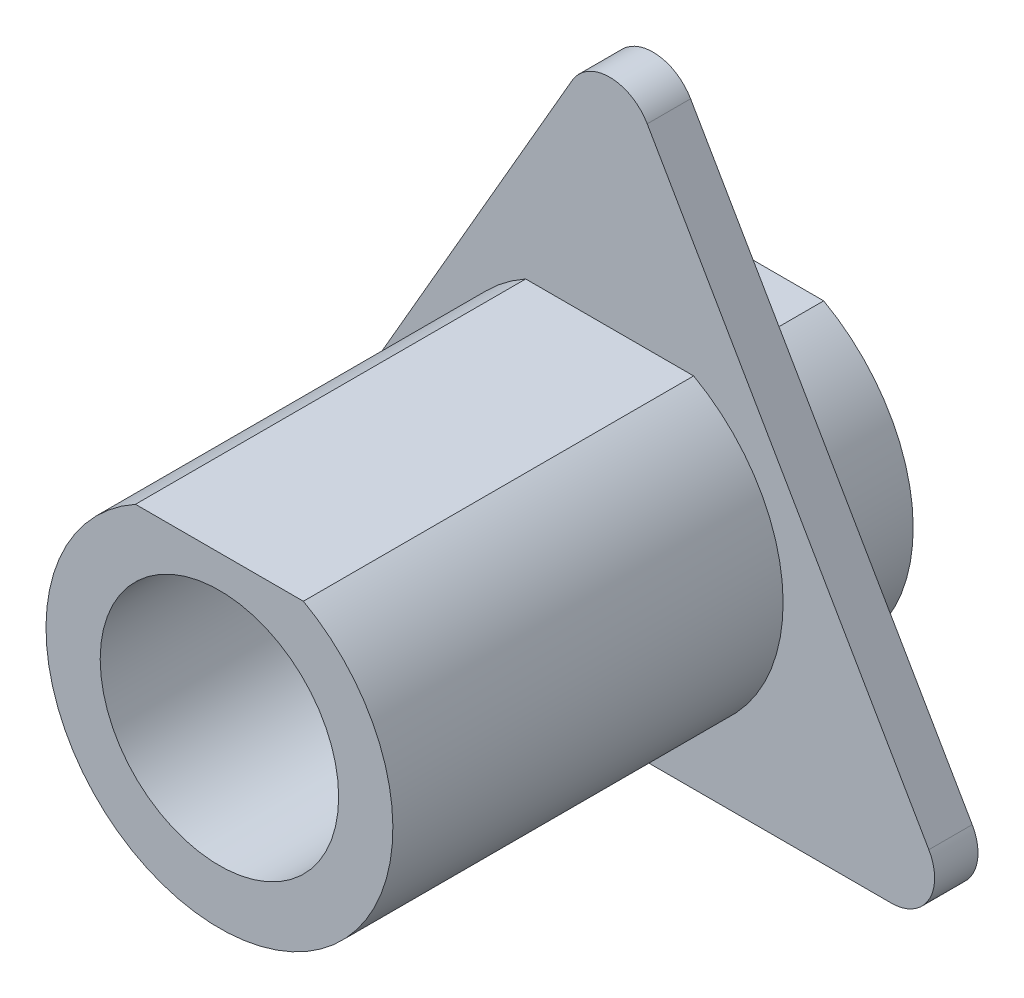
ISO-10303-21;
HEADER;
FILE_DESCRIPTION(('STEP AP214'),'2;1');
FILE_NAME('part.step','',(''),(''),'','','');
FILE_SCHEMA(('AUTOMOTIVE_DESIGN { 1 0 10303 214 1 1 1 1 }'));
ENDSEC;
DATA;
#1=APPLICATION_CONTEXT('core data for automotive mechanical design processes');
#2=APPLICATION_PROTOCOL_DEFINITION('international standard','automotive_design',2000,#1);
#3=PRODUCT_CONTEXT('',#1,'mechanical');
#4=PRODUCT('Part','Part','',(#3));
#5=PRODUCT_RELATED_PRODUCT_CATEGORY('part','',(#4));
#6=PRODUCT_DEFINITION_FORMATION('','',#4);
#7=PRODUCT_DEFINITION_CONTEXT('part definition',#1,'design');
#8=PRODUCT_DEFINITION('design','',#6,#7);
#9=PRODUCT_DEFINITION_SHAPE('','',#8);
#10=(LENGTH_UNIT() NAMED_UNIT(*) SI_UNIT(.MILLI.,.METRE.));
#11=(NAMED_UNIT(*) PLANE_ANGLE_UNIT() SI_UNIT($,.RADIAN.));
#12=(NAMED_UNIT(*) SI_UNIT($,.STERADIAN.) SOLID_ANGLE_UNIT());
#13=UNCERTAINTY_MEASURE_WITH_UNIT(LENGTH_MEASURE(1.E-05),#10,'distance_accuracy_value','');
#14=(GEOMETRIC_REPRESENTATION_CONTEXT(3) GLOBAL_UNCERTAINTY_ASSIGNED_CONTEXT((#13)) GLOBAL_UNIT_ASSIGNED_CONTEXT((#10,
#11,#12)) REPRESENTATION_CONTEXT('',''));
#15=CARTESIAN_POINT('',(0.,0.,0.));
#16=DIRECTION('',(0.,0.,1.));
#17=DIRECTION('',(1.,0.,0.));
#18=AXIS2_PLACEMENT_3D('',#15,#16,#17);
#19=CARTESIAN_POINT('',(0.,0.,12.));
#20=DIRECTION('',(0.,0.,-1.));
#21=DIRECTION('',(-1.,0.,0.));
#22=AXIS2_PLACEMENT_3D('',#19,#20,#21);
#23=CYLINDRICAL_SURFACE('',#22,4.);
#24=CARTESIAN_POINT('',(0.,0.,2.));
#25=DIRECTION('',(0.,0.,1.));
#26=DIRECTION('',(1.,0.,0.));
#27=AXIS2_PLACEMENT_3D('',#24,#25,#26);
#28=CIRCLE('',#27,4.);
#29=CARTESIAN_POINT('',(-1.93649167310371,3.5,2.));
#30=VERTEX_POINT('',#29);
#31=CARTESIAN_POINT('',(1.93649167310371,3.5,2.));
#32=VERTEX_POINT('',#31);
#33=EDGE_CURVE('E198',#30,#32,#28,.T.);
#34=ORIENTED_EDGE('',*,*,#33,.F.);
#35=DIRECTION('',(0.,0.,-1.));
#36=VECTOR('',#35,1.);
#37=CARTESIAN_POINT('',(-1.93649167310371,3.5,12.));
#38=LINE('',#37,#36);
#39=CARTESIAN_POINT('',(-1.93649167310371,3.5,0.));
#40=VERTEX_POINT('',#39);
#41=EDGE_CURVE('E211',#30,#40,#38,.T.);
#42=ORIENTED_EDGE('',*,*,#41,.T.);
#43=CARTESIAN_POINT('',(0.,0.,0.));
#44=DIRECTION('',(0.,0.,1.));
#45=DIRECTION('',(1.,0.,0.));
#46=AXIS2_PLACEMENT_3D('',#43,#44,#45);
#47=CIRCLE('',#46,4.);
#48=CARTESIAN_POINT('',(1.93649167310371,3.5,0.));
#49=VERTEX_POINT('',#48);
#50=EDGE_CURVE('E202',#40,#49,#47,.T.);
#51=ORIENTED_EDGE('',*,*,#50,.T.);
#52=DIRECTION('',(0.,0.,-1.));
#53=VECTOR('',#52,1.);
#54=CARTESIAN_POINT('',(1.93649167310371,3.5,12.));
#55=LINE('',#54,#53);
#56=EDGE_CURVE('E222',#32,#49,#55,.T.);
#57=ORIENTED_EDGE('',*,*,#56,.F.);
#58=EDGE_LOOP('',(#34,#42,#51,#57));
#59=FACE_BOUND('',#58,.T.);
#60=ADVANCED_FACE('F39',(#59),#23,.T.);
#61=CARTESIAN_POINT('',(-1.93649167310371,3.5,12.));
#62=DIRECTION('',(0.,-1.,0.));
#63=DIRECTION('',(0.,0.,-1.));
#64=AXIS2_PLACEMENT_3D('',#61,#62,#63);
#65=PLANE('',#64);
#66=DIRECTION('',(-1.,0.,0.));
#67=VECTOR('',#66,1.);
#68=CARTESIAN_POINT('',(-1.93649167310371,3.5,2.));
#69=LINE('',#68,#67);
#70=EDGE_CURVE('E11',#32,#30,#69,.T.);
#71=ORIENTED_EDGE('',*,*,#70,.F.);
#72=ORIENTED_EDGE('',*,*,#56,.T.);
#73=DIRECTION('',(-1.,0.,0.));
#74=VECTOR('',#73,1.);
#75=CARTESIAN_POINT('',(-1.93649167310371,3.5,0.));
#76=LINE('',#75,#74);
#77=EDGE_CURVE('E208',#49,#40,#76,.T.);
#78=ORIENTED_EDGE('',*,*,#77,.T.);
#79=ORIENTED_EDGE('',*,*,#41,.F.);
#80=EDGE_LOOP('',(#71,#72,#78,#79));
#81=FACE_BOUND('',#80,.T.);
#82=ADVANCED_FACE('F242',(#81),#65,.F.);
#83=CARTESIAN_POINT('',(0.,0.,0.));
#84=DIRECTION('',(0.,0.,1.));
#85=DIRECTION('',(1.,0.,0.));
#86=AXIS2_PLACEMENT_3D('',#83,#84,#85);
#87=PLANE('',#86);
#88=CARTESIAN_POINT('',(0.,0.,0.));
#89=DIRECTION('',(0.,0.,1.));
#90=DIRECTION('',(1.,0.,0.));
#91=AXIS2_PLACEMENT_3D('',#88,#89,#90);
#92=CIRCLE('',#91,2.75);
#93=CARTESIAN_POINT('',(2.75,0.,0.));
#94=VERTEX_POINT('',#93);
#95=EDGE_CURVE('E152',#94,#94,#92,.T.);
#96=ORIENTED_EDGE('',*,*,#95,.T.);
#97=EDGE_LOOP('',(#96));
#98=FACE_BOUND('',#97,.T.);
#99=ORIENTED_EDGE('',*,*,#50,.F.);
#100=ORIENTED_EDGE('',*,*,#77,.F.);
#101=EDGE_LOOP('',(#99,#100));
#102=FACE_BOUND('',#101,.T.);
#103=ADVANCED_FACE('F253',(#98,#102),#87,.F.);
#104=CARTESIAN_POINT('',(-6.49519052838365,-3.75000000000021,2.));
#105=DIRECTION('',(0.,0.,1.));
#106=DIRECTION('',(1.,0.,0.));
#107=AXIS2_PLACEMENT_3D('',#104,#105,#106);
#108=PLANE('',#107);
#109=CARTESIAN_POINT('',(-6.49519052838365,-3.75000000000021,2.));
#110=DIRECTION('',(0.,0.,1.));
#111=DIRECTION('',(1.,0.,0.));
#112=AXIS2_PLACEMENT_3D('',#109,#110,#111);
#113=CIRCLE('',#112,0.999999999999994);
#114=CARTESIAN_POINT('',(-7.36121593216808,-3.25000000000021,2.));
#115=VERTEX_POINT('',#114);
#116=CARTESIAN_POINT('',(-6.49519052838365,-4.75000000000021,2.));
#117=VERTEX_POINT('',#116);
#118=EDGE_CURVE('E135',#115,#117,#113,.T.);
#119=ORIENTED_EDGE('',*,*,#118,.F.);
#120=DIRECTION('',(-0.5,-0.866025403784439,0.));
#121=VECTOR('',#120,1.);
#122=CARTESIAN_POINT('',(-0.866025403784432,8.00000000000041,2.));
#123=LINE('',#122,#121);
#124=CARTESIAN_POINT('',(-0.866025403784432,8.00000000000041,2.));
#125=VERTEX_POINT('',#124);
#126=EDGE_CURVE('E127',#125,#115,#123,.T.);
#127=ORIENTED_EDGE('',*,*,#126,.F.);
#128=CARTESIAN_POINT('',(0.,7.50000000000041,2.));
#129=DIRECTION('',(0.,0.,1.));
#130=DIRECTION('',(1.,0.,0.));
#131=AXIS2_PLACEMENT_3D('',#128,#129,#130);
#132=CIRCLE('',#131,0.999999999999998);
#133=CARTESIAN_POINT('',(0.866025403784438,8.00000000000041,2.));
#134=VERTEX_POINT('',#133);
#135=EDGE_CURVE('E161',#134,#125,#132,.T.);
#136=ORIENTED_EDGE('',*,*,#135,.F.);
#137=DIRECTION('',(-0.5,0.866025403784439,0.));
#138=VECTOR('',#137,1.);
#139=CARTESIAN_POINT('',(7.36121593216809,-3.25000000000021,2.));
#140=LINE('',#139,#138);
#141=CARTESIAN_POINT('',(7.36121593216809,-3.25000000000021,2.));
#142=VERTEX_POINT('',#141);
#143=EDGE_CURVE('E157',#142,#134,#140,.T.);
#144=ORIENTED_EDGE('',*,*,#143,.F.);
#145=CARTESIAN_POINT('',(6.49519052838365,-3.75000000000021,2.));
#146=DIRECTION('',(0.,0.,1.));
#147=DIRECTION('',(1.,0.,0.));
#148=AXIS2_PLACEMENT_3D('',#145,#146,#147);
#149=CIRCLE('',#148,0.999999999999998);
#150=CARTESIAN_POINT('',(6.49519052838365,-4.7500000000002,2.));
#151=VERTEX_POINT('',#150);
#152=EDGE_CURVE('E139',#151,#142,#149,.T.);
#153=ORIENTED_EDGE('',*,*,#152,.F.);
#154=DIRECTION('',(1.,0.,0.));
#155=VECTOR('',#154,1.);
#156=CARTESIAN_POINT('',(-6.49519052838365,-4.75000000000021,2.));
#157=LINE('',#156,#155);
#158=EDGE_CURVE('E118',#117,#151,#157,.T.);
#159=ORIENTED_EDGE('',*,*,#158,.F.);
#160=EDGE_LOOP('',(#119,#127,#136,#144,#153,#159));
#161=FACE_BOUND('',#160,.T.);
#162=ORIENTED_EDGE('',*,*,#70,.T.);
#163=ORIENTED_EDGE('',*,*,#33,.T.);
#164=EDGE_LOOP('',(#162,#163));
#165=FACE_BOUND('',#164,.T.);
#166=ADVANCED_FACE('F132',(#161,#165),#108,.F.);
#167=CARTESIAN_POINT('',(-6.49519052838365,-3.75000000000021,3.));
#168=DIRECTION('',(0.,0.,1.));
#169=DIRECTION('',(1.,0.,0.));
#170=AXIS2_PLACEMENT_3D('',#167,#168,#169);
#171=PLANE('',#170);
#172=CARTESIAN_POINT('',(-6.49519052838365,-3.75000000000021,3.));
#173=DIRECTION('',(0.,0.,1.));
#174=DIRECTION('',(1.,0.,0.));
#175=AXIS2_PLACEMENT_3D('',#172,#173,#174);
#176=CIRCLE('',#175,0.999999999999994);
#177=CARTESIAN_POINT('',(-7.36121593216808,-3.25000000000021,3.));
#178=VERTEX_POINT('',#177);
#179=CARTESIAN_POINT('',(-6.49519052838365,-4.75000000000021,3.));
#180=VERTEX_POINT('',#179);
#181=EDGE_CURVE('E167',#178,#180,#176,.T.);
#182=ORIENTED_EDGE('',*,*,#181,.T.);
#183=DIRECTION('',(1.,0.,0.));
#184=VECTOR('',#183,1.);
#185=CARTESIAN_POINT('',(-6.49519052838365,-4.75000000000021,3.));
#186=LINE('',#185,#184);
#187=CARTESIAN_POINT('',(6.49519052838365,-4.7500000000002,3.));
#188=VERTEX_POINT('',#187);
#189=EDGE_CURVE('E120',#180,#188,#186,.T.);
#190=ORIENTED_EDGE('',*,*,#189,.T.);
#191=CARTESIAN_POINT('',(6.49519052838365,-3.75000000000021,3.));
#192=DIRECTION('',(0.,0.,1.));
#193=DIRECTION('',(1.,0.,0.));
#194=AXIS2_PLACEMENT_3D('',#191,#192,#193);
#195=CIRCLE('',#194,0.999999999999998);
#196=CARTESIAN_POINT('',(7.36121593216809,-3.25000000000021,3.));
#197=VERTEX_POINT('',#196);
#198=EDGE_CURVE('E172',#188,#197,#195,.T.);
#199=ORIENTED_EDGE('',*,*,#198,.T.);
#200=DIRECTION('',(-0.5,0.866025403784439,0.));
#201=VECTOR('',#200,1.);
#202=CARTESIAN_POINT('',(7.36121593216809,-3.25000000000021,3.));
#203=LINE('',#202,#201);
#204=CARTESIAN_POINT('',(0.866025403784438,8.00000000000041,3.));
#205=VERTEX_POINT('',#204);
#206=EDGE_CURVE('E176',#197,#205,#203,.T.);
#207=ORIENTED_EDGE('',*,*,#206,.T.);
#208=CARTESIAN_POINT('',(0.,7.50000000000041,3.));
#209=DIRECTION('',(0.,0.,1.));
#210=DIRECTION('',(1.,0.,0.));
#211=AXIS2_PLACEMENT_3D('',#208,#209,#210);
#212=CIRCLE('',#211,0.999999999999998);
#213=CARTESIAN_POINT('',(-0.866025403784432,8.00000000000041,3.));
#214=VERTEX_POINT('',#213);
#215=EDGE_CURVE('E149',#205,#214,#212,.T.);
#216=ORIENTED_EDGE('',*,*,#215,.T.);
#217=DIRECTION('',(-0.5,-0.866025403784439,0.));
#218=VECTOR('',#217,1.);
#219=CARTESIAN_POINT('',(-0.866025403784432,8.00000000000041,3.));
#220=LINE('',#219,#218);
#221=EDGE_CURVE('E145',#214,#178,#220,.T.);
#222=ORIENTED_EDGE('',*,*,#221,.T.);
#223=EDGE_LOOP('',(#182,#190,#199,#207,#216,#222));
#224=FACE_BOUND('',#223,.T.);
#225=CARTESIAN_POINT('',(0.,0.,3.));
#226=DIRECTION('',(0.,0.,1.));
#227=DIRECTION('',(1.,0.,0.));
#228=AXIS2_PLACEMENT_3D('',#225,#226,#227);
#229=CIRCLE('',#228,4.);
#230=CARTESIAN_POINT('',(-1.93649167310371,3.5,3.));
#231=VERTEX_POINT('',#230);
#232=CARTESIAN_POINT('',(1.93649167310371,3.5,3.));
#233=VERTEX_POINT('',#232);
#234=EDGE_CURVE('E60',#231,#233,#229,.T.);
#235=ORIENTED_EDGE('',*,*,#234,.F.);
#236=DIRECTION('',(-1.,0.,0.));
#237=VECTOR('',#236,1.);
#238=CARTESIAN_POINT('',(-1.93649167310371,3.5,3.));
#239=LINE('',#238,#237);
#240=EDGE_CURVE('E48',#233,#231,#239,.T.);
#241=ORIENTED_EDGE('',*,*,#240,.F.);
#242=EDGE_LOOP('',(#235,#241));
#243=FACE_BOUND('',#242,.T.);
#244=ADVANCED_FACE('F269',(#224,#243),#171,.T.);
#245=CARTESIAN_POINT('',(-6.49519052838365,-3.75000000000021,2.));
#246=DIRECTION('',(0.,0.,1.));
#247=DIRECTION('',(1.,0.,0.));
#248=AXIS2_PLACEMENT_3D('',#245,#246,#247);
#249=CYLINDRICAL_SURFACE('',#248,0.999999999999994);
#250=ORIENTED_EDGE('',*,*,#181,.F.);
#251=DIRECTION('',(0.,0.,1.));
#252=VECTOR('',#251,1.);
#253=CARTESIAN_POINT('',(-7.36121593216808,-3.25000000000021,2.));
#254=LINE('',#253,#252);
#255=EDGE_CURVE('E143',#115,#178,#254,.T.);
#256=ORIENTED_EDGE('',*,*,#255,.F.);
#257=ORIENTED_EDGE('',*,*,#118,.T.);
#258=DIRECTION('',(0.,0.,1.));
#259=VECTOR('',#258,1.);
#260=CARTESIAN_POINT('',(-6.49519052838365,-4.75000000000021,2.));
#261=LINE('',#260,#259);
#262=EDGE_CURVE('E115',#117,#180,#261,.T.);
#263=ORIENTED_EDGE('',*,*,#262,.T.);
#264=EDGE_LOOP('',(#250,#256,#257,#263));
#265=FACE_BOUND('',#264,.T.);
#266=ADVANCED_FACE('F142',(#265),#249,.T.);
#267=CARTESIAN_POINT('',(-0.866025403784432,8.00000000000041,2.));
#268=DIRECTION('',(-0.866025403784439,0.5,0.));
#269=DIRECTION('',(-0.5,-0.866025403784439,0.));
#270=AXIS2_PLACEMENT_3D('',#267,#268,#269);
#271=PLANE('',#270);
#272=ORIENTED_EDGE('',*,*,#221,.F.);
#273=DIRECTION('',(0.,0.,1.));
#274=VECTOR('',#273,1.);
#275=CARTESIAN_POINT('',(-0.866025403784432,8.00000000000041,2.));
#276=LINE('',#275,#274);
#277=EDGE_CURVE('E185',#125,#214,#276,.T.);
#278=ORIENTED_EDGE('',*,*,#277,.F.);
#279=ORIENTED_EDGE('',*,*,#126,.T.);
#280=ORIENTED_EDGE('',*,*,#255,.T.);
#281=EDGE_LOOP('',(#272,#278,#279,#280));
#282=FACE_BOUND('',#281,.T.);
#283=ADVANCED_FACE('F273',(#282),#271,.T.);
#284=CARTESIAN_POINT('',(0.,7.50000000000041,2.));
#285=DIRECTION('',(0.,0.,1.));
#286=DIRECTION('',(1.,0.,0.));
#287=AXIS2_PLACEMENT_3D('',#284,#285,#286);
#288=CYLINDRICAL_SURFACE('',#287,0.999999999999998);
#289=ORIENTED_EDGE('',*,*,#215,.F.);
#290=DIRECTION('',(0.,0.,1.));
#291=VECTOR('',#290,1.);
#292=CARTESIAN_POINT('',(0.866025403784438,8.00000000000041,2.));
#293=LINE('',#292,#291);
#294=EDGE_CURVE('E188',#134,#205,#293,.T.);
#295=ORIENTED_EDGE('',*,*,#294,.F.);
#296=ORIENTED_EDGE('',*,*,#135,.T.);
#297=ORIENTED_EDGE('',*,*,#277,.T.);
#298=EDGE_LOOP('',(#289,#295,#296,#297));
#299=FACE_BOUND('',#298,.T.);
#300=ADVANCED_FACE('F276',(#299),#288,.T.);
#301=CARTESIAN_POINT('',(7.36121593216809,-3.25000000000021,2.));
#302=DIRECTION('',(0.866025403784439,0.5,0.));
#303=DIRECTION('',(-0.5,0.866025403784439,0.));
#304=AXIS2_PLACEMENT_3D('',#301,#302,#303);
#305=PLANE('',#304);
#306=ORIENTED_EDGE('',*,*,#206,.F.);
#307=DIRECTION('',(0.,0.,1.));
#308=VECTOR('',#307,1.);
#309=CARTESIAN_POINT('',(7.36121593216809,-3.25000000000021,2.));
#310=LINE('',#309,#308);
#311=EDGE_CURVE('E191',#142,#197,#310,.T.);
#312=ORIENTED_EDGE('',*,*,#311,.F.);
#313=ORIENTED_EDGE('',*,*,#143,.T.);
#314=ORIENTED_EDGE('',*,*,#294,.T.);
#315=EDGE_LOOP('',(#306,#312,#313,#314));
#316=FACE_BOUND('',#315,.T.);
#317=ADVANCED_FACE('F280',(#316),#305,.T.);
#318=CARTESIAN_POINT('',(6.49519052838365,-3.75000000000021,2.));
#319=DIRECTION('',(0.,0.,1.));
#320=DIRECTION('',(1.,0.,0.));
#321=AXIS2_PLACEMENT_3D('',#318,#319,#320);
#322=CYLINDRICAL_SURFACE('',#321,0.999999999999998);
#323=ORIENTED_EDGE('',*,*,#198,.F.);
#324=DIRECTION('',(0.,0.,1.));
#325=VECTOR('',#324,1.);
#326=CARTESIAN_POINT('',(6.49519052838365,-4.7500000000002,2.));
#327=LINE('',#326,#325);
#328=EDGE_CURVE('E126',#151,#188,#327,.T.);
#329=ORIENTED_EDGE('',*,*,#328,.F.);
#330=ORIENTED_EDGE('',*,*,#152,.T.);
#331=ORIENTED_EDGE('',*,*,#311,.T.);
#332=EDGE_LOOP('',(#323,#329,#330,#331));
#333=FACE_BOUND('',#332,.T.);
#334=ADVANCED_FACE('F243',(#333),#322,.T.);
#335=CARTESIAN_POINT('',(-6.49519052838365,-4.75000000000021,2.));
#336=DIRECTION('',(0.,-1.,0.));
#337=DIRECTION('',(0.,0.,-1.));
#338=AXIS2_PLACEMENT_3D('',#335,#336,#337);
#339=PLANE('',#338);
#340=ORIENTED_EDGE('',*,*,#189,.F.);
#341=ORIENTED_EDGE('',*,*,#262,.F.);
#342=ORIENTED_EDGE('',*,*,#158,.T.);
#343=ORIENTED_EDGE('',*,*,#328,.T.);
#344=EDGE_LOOP('',(#340,#341,#342,#343));
#345=FACE_BOUND('',#344,.T.);
#346=ADVANCED_FACE('F117',(#345),#339,.T.);
#347=CARTESIAN_POINT('',(0.,0.,12.));
#348=DIRECTION('',(0.,0.,1.));
#349=DIRECTION('',(1.,0.,0.));
#350=AXIS2_PLACEMENT_3D('',#347,#348,#349);
#351=PLANE('',#350);
#352=CARTESIAN_POINT('',(0.,0.,12.));
#353=DIRECTION('',(0.,0.,1.));
#354=DIRECTION('',(1.,0.,0.));
#355=AXIS2_PLACEMENT_3D('',#352,#353,#354);
#356=CIRCLE('',#355,2.75);
#357=CARTESIAN_POINT('',(2.75,0.,12.));
#358=VERTEX_POINT('',#357);
#359=EDGE_CURVE('E380',#358,#358,#356,.T.);
#360=ORIENTED_EDGE('',*,*,#359,.F.);
#361=EDGE_LOOP('',(#360));
#362=FACE_BOUND('',#361,.T.);
#363=CARTESIAN_POINT('',(0.,0.,12.));
#364=DIRECTION('',(0.,0.,1.));
#365=DIRECTION('',(1.,0.,0.));
#366=AXIS2_PLACEMENT_3D('',#363,#364,#365);
#367=CIRCLE('',#366,4.);
#368=CARTESIAN_POINT('',(-1.93649167310371,3.5,12.));
#369=VERTEX_POINT('',#368);
#370=CARTESIAN_POINT('',(1.93649167310371,3.5,12.));
#371=VERTEX_POINT('',#370);
#372=EDGE_CURVE('E203',#369,#371,#367,.T.);
#373=ORIENTED_EDGE('',*,*,#372,.T.);
#374=DIRECTION('',(-1.,0.,0.));
#375=VECTOR('',#374,1.);
#376=CARTESIAN_POINT('',(-1.93649167310371,3.5,12.));
#377=LINE('',#376,#375);
#378=EDGE_CURVE('E207',#371,#369,#377,.T.);
#379=ORIENTED_EDGE('',*,*,#378,.T.);
#380=EDGE_LOOP('',(#373,#379));
#381=FACE_BOUND('',#380,.T.);
#382=ADVANCED_FACE('F234',(#362,#381),#351,.T.);
#383=EDGE_CURVE('E223',#371,#233,#55,.T.);
#384=ORIENTED_EDGE('',*,*,#383,.T.);
#385=ORIENTED_EDGE('',*,*,#240,.T.);
#386=EDGE_CURVE('E218',#369,#231,#38,.T.);
#387=ORIENTED_EDGE('',*,*,#386,.F.);
#388=ORIENTED_EDGE('',*,*,#378,.F.);
#389=EDGE_LOOP('',(#384,#385,#387,#388));
#390=FACE_BOUND('',#389,.T.);
#391=ADVANCED_FACE('F229',(#390),#65,.F.);
#392=ORIENTED_EDGE('',*,*,#386,.T.);
#393=ORIENTED_EDGE('',*,*,#234,.T.);
#394=ORIENTED_EDGE('',*,*,#383,.F.);
#395=ORIENTED_EDGE('',*,*,#372,.F.);
#396=EDGE_LOOP('',(#392,#393,#394,#395));
#397=FACE_BOUND('',#396,.T.);
#398=ADVANCED_FACE('F41',(#397),#23,.T.);
#399=CARTESIAN_POINT('',(0.,0.,-88.));
#400=DIRECTION('',(0.,0.,1.));
#401=DIRECTION('',(1.,0.,0.));
#402=AXIS2_PLACEMENT_3D('',#399,#400,#401);
#403=CYLINDRICAL_SURFACE('',#402,2.75);
#404=ORIENTED_EDGE('',*,*,#359,.T.);
#405=EDGE_LOOP('',(#404));
#406=FACE_BOUND('',#405,.T.);
#407=ORIENTED_EDGE('',*,*,#95,.F.);
#408=EDGE_LOOP('',(#407));
#409=FACE_BOUND('',#408,.T.);
#410=ADVANCED_FACE('F256',(#406,#409),#403,.F.);
#411=CLOSED_SHELL('',(#60,#82,#103,#166,#244,#266,#283,#300,#317,#334,#346,#382,#391,#398,#410));
#412=MANIFOLD_SOLID_BREP('B2',#411);
#413=ADVANCED_BREP_SHAPE_REPRESENTATION('',(#18,#412),#14);
#414=SHAPE_DEFINITION_REPRESENTATION(#9,#413);
ENDSEC;
END-ISO-10303-21;
